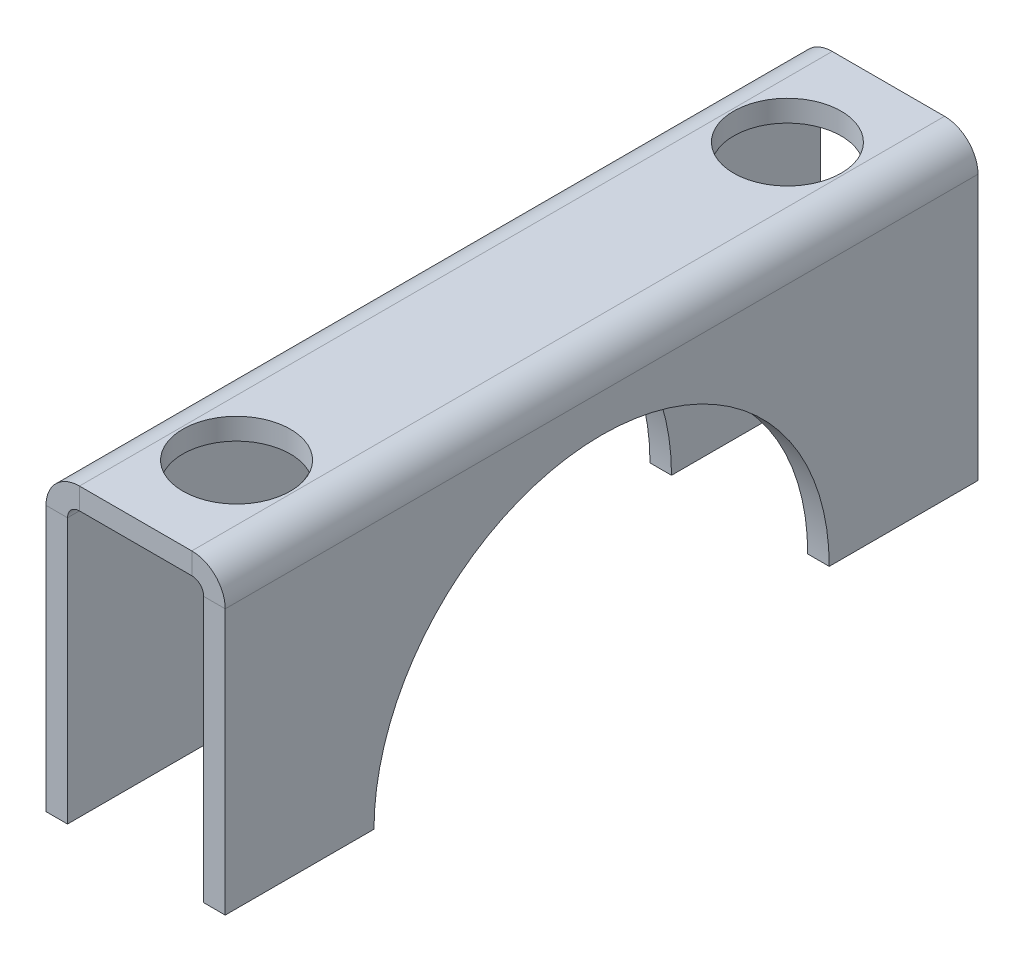
ISO-10303-21;
HEADER;
FILE_DESCRIPTION(('STEP AP214'),'2;1');
FILE_NAME('part.step','',(''),(''),'','','');
FILE_SCHEMA(('AUTOMOTIVE_DESIGN { 1 0 10303 214 1 1 1 1 }'));
ENDSEC;
DATA;
#1=APPLICATION_CONTEXT('core data for automotive mechanical design processes');
#2=APPLICATION_PROTOCOL_DEFINITION('international standard','automotive_design',2000,#1);
#3=PRODUCT_CONTEXT('',#1,'mechanical');
#4=PRODUCT('Part','Part','',(#3));
#5=PRODUCT_RELATED_PRODUCT_CATEGORY('part','',(#4));
#6=PRODUCT_DEFINITION_FORMATION('','',#4);
#7=PRODUCT_DEFINITION_CONTEXT('part definition',#1,'design');
#8=PRODUCT_DEFINITION('design','',#6,#7);
#9=PRODUCT_DEFINITION_SHAPE('','',#8);
#10=(LENGTH_UNIT() NAMED_UNIT(*) SI_UNIT(.MILLI.,.METRE.));
#11=(NAMED_UNIT(*) PLANE_ANGLE_UNIT() SI_UNIT($,.RADIAN.));
#12=(NAMED_UNIT(*) SI_UNIT($,.STERADIAN.) SOLID_ANGLE_UNIT());
#13=UNCERTAINTY_MEASURE_WITH_UNIT(LENGTH_MEASURE(1.E-05),#10,'distance_accuracy_value','');
#14=(GEOMETRIC_REPRESENTATION_CONTEXT(3) GLOBAL_UNCERTAINTY_ASSIGNED_CONTEXT((#13)) GLOBAL_UNIT_ASSIGNED_CONTEXT((#10,
#11,#12)) REPRESENTATION_CONTEXT('',''));
#15=CARTESIAN_POINT('',(0.,0.,0.));
#16=DIRECTION('',(0.,0.,1.));
#17=DIRECTION('',(1.,0.,0.));
#18=AXIS2_PLACEMENT_3D('',#15,#16,#17);
#19=CARTESIAN_POINT('',(15.,0.,63.));
#20=DIRECTION('',(0.,-1.,0.));
#21=DIRECTION('',(0.,0.,-1.));
#22=AXIS2_PLACEMENT_3D('',#19,#20,#21);
#23=PLANE('',#22);
#24=DIRECTION('',(1.,0.,0.));
#25=VECTOR('',#24,1.);
#26=CARTESIAN_POINT('',(-5.,0.,12.45));
#27=LINE('',#26,#25);
#28=CARTESIAN_POINT('',(13.2,0.,12.45));
#29=VERTEX_POINT('',#28);
#30=CARTESIAN_POINT('',(15.,0.,12.45));
#31=VERTEX_POINT('',#30);
#32=EDGE_CURVE('E53',#29,#31,#27,.T.);
#33=ORIENTED_EDGE('',*,*,#32,.F.);
#34=DIRECTION('',(0.,0.,-1.));
#35=VECTOR('',#34,1.);
#36=CARTESIAN_POINT('',(13.2,0.,63.));
#37=LINE('',#36,#35);
#38=CARTESIAN_POINT('',(13.2,0.,0.));
#39=VERTEX_POINT('',#38);
#40=EDGE_CURVE('E174',#29,#39,#37,.T.);
#41=ORIENTED_EDGE('',*,*,#40,.T.);
#42=DIRECTION('',(-1.,0.,0.));
#43=VECTOR('',#42,1.);
#44=CARTESIAN_POINT('',(15.,0.,0.));
#45=LINE('',#44,#43);
#46=CARTESIAN_POINT('',(15.,0.,0.));
#47=VERTEX_POINT('',#46);
#48=EDGE_CURVE('E242',#47,#39,#45,.T.);
#49=ORIENTED_EDGE('',*,*,#48,.F.);
#50=DIRECTION('',(0.,0.,-1.));
#51=VECTOR('',#50,1.);
#52=CARTESIAN_POINT('',(15.,0.,63.));
#53=LINE('',#52,#51);
#54=EDGE_CURVE('E175',#31,#47,#53,.T.);
#55=ORIENTED_EDGE('',*,*,#54,.F.);
#56=EDGE_LOOP('',(#33,#41,#49,#55));
#57=FACE_BOUND('',#56,.T.);
#58=ADVANCED_FACE('F38',(#57),#23,.T.);
#59=CARTESIAN_POINT('',(1.8,0.,63.));
#60=DIRECTION('',(0.,-1.,0.));
#61=DIRECTION('',(0.,0.,-1.));
#62=AXIS2_PLACEMENT_3D('',#59,#60,#61);
#63=PLANE('',#62);
#64=DIRECTION('',(1.,0.,0.));
#65=VECTOR('',#64,1.);
#66=CARTESIAN_POINT('',(-5.,0.,12.45));
#67=LINE('',#66,#65);
#68=CARTESIAN_POINT('',(0.,0.,12.45));
#69=VERTEX_POINT('',#68);
#70=CARTESIAN_POINT('',(1.8,0.,12.45));
#71=VERTEX_POINT('',#70);
#72=EDGE_CURVE('E61',#69,#71,#67,.T.);
#73=ORIENTED_EDGE('',*,*,#72,.F.);
#74=DIRECTION('',(0.,0.,-1.));
#75=VECTOR('',#74,1.);
#76=CARTESIAN_POINT('',(0.,0.,63.));
#77=LINE('',#76,#75);
#78=CARTESIAN_POINT('',(0.,0.,0.));
#79=VERTEX_POINT('',#78);
#80=EDGE_CURVE('E281',#69,#79,#77,.T.);
#81=ORIENTED_EDGE('',*,*,#80,.T.);
#82=DIRECTION('',(-1.,0.,0.));
#83=VECTOR('',#82,1.);
#84=CARTESIAN_POINT('',(1.8,0.,0.));
#85=LINE('',#84,#83);
#86=CARTESIAN_POINT('',(1.8,0.,0.));
#87=VERTEX_POINT('',#86);
#88=EDGE_CURVE('E260',#87,#79,#85,.T.);
#89=ORIENTED_EDGE('',*,*,#88,.F.);
#90=DIRECTION('',(0.,0.,-1.));
#91=VECTOR('',#90,1.);
#92=CARTESIAN_POINT('',(1.8,0.,63.));
#93=LINE('',#92,#91);
#94=EDGE_CURVE('E277',#71,#87,#93,.T.);
#95=ORIENTED_EDGE('',*,*,#94,.F.);
#96=EDGE_LOOP('',(#73,#81,#89,#95));
#97=FACE_BOUND('',#96,.T.);
#98=ADVANCED_FACE('F353',(#97),#63,.T.);
#99=CARTESIAN_POINT('',(2.8,25.,63.));
#100=DIRECTION('',(0.,0.,1.));
#101=DIRECTION('',(1.,0.,0.));
#102=AXIS2_PLACEMENT_3D('',#99,#100,#101);
#103=PLANE('',#102);
#104=DIRECTION('',(0.,-1.,0.));
#105=VECTOR('',#104,1.);
#106=CARTESIAN_POINT('',(2.8,25.,63.));
#107=LINE('',#106,#105);
#108=CARTESIAN_POINT('',(2.8,25.,63.));
#109=VERTEX_POINT('',#108);
#110=CARTESIAN_POINT('',(2.8,23.2,63.));
#111=VERTEX_POINT('',#110);
#112=EDGE_CURVE('E46',#109,#111,#107,.T.);
#113=ORIENTED_EDGE('',*,*,#112,.F.);
#114=CARTESIAN_POINT('',(2.8,22.2,63.));
#115=DIRECTION('',(0.,0.,1.));
#116=DIRECTION('',(1.,0.,0.));
#117=AXIS2_PLACEMENT_3D('',#114,#115,#116);
#118=CIRCLE('',#117,2.8);
#119=CARTESIAN_POINT('',(0.,22.2,63.));
#120=VERTEX_POINT('',#119);
#121=EDGE_CURVE('E318',#120,#109,#118,.F.);
#122=ORIENTED_EDGE('',*,*,#121,.F.);
#123=DIRECTION('',(-1.,0.,0.));
#124=VECTOR('',#123,1.);
#125=CARTESIAN_POINT('',(1.8,22.2,63.));
#126=LINE('',#125,#124);
#127=CARTESIAN_POINT('',(1.8,22.2,63.));
#128=VERTEX_POINT('',#127);
#129=EDGE_CURVE('E194',#128,#120,#126,.T.);
#130=ORIENTED_EDGE('',*,*,#129,.F.);
#131=CARTESIAN_POINT('',(2.8,22.2,63.));
#132=DIRECTION('',(0.,0.,1.));
#133=DIRECTION('',(1.,0.,0.));
#134=AXIS2_PLACEMENT_3D('',#131,#132,#133);
#135=CIRCLE('',#134,1.);
#136=EDGE_CURVE('E210',#128,#111,#135,.F.);
#137=ORIENTED_EDGE('',*,*,#136,.T.);
#138=EDGE_LOOP('',(#113,#122,#130,#137));
#139=FACE_BOUND('',#138,.T.);
#140=ADVANCED_FACE('F40',(#139),#103,.T.);
#141=CARTESIAN_POINT('',(1.8,22.2,63.));
#142=DIRECTION('',(0.,0.,1.));
#143=DIRECTION('',(1.,0.,0.));
#144=AXIS2_PLACEMENT_3D('',#141,#142,#143);
#145=PLANE('',#144);
#146=DIRECTION('',(1.,0.,0.));
#147=VECTOR('',#146,1.);
#148=CARTESIAN_POINT('',(0.,25.,63.));
#149=LINE('',#148,#147);
#150=CARTESIAN_POINT('',(12.2,25.,63.));
#151=VERTEX_POINT('',#150);
#152=EDGE_CURVE('E204',#109,#151,#149,.T.);
#153=ORIENTED_EDGE('',*,*,#152,.F.);
#154=ORIENTED_EDGE('',*,*,#112,.T.);
#155=DIRECTION('',(1.,0.,0.));
#156=VECTOR('',#155,1.);
#157=CARTESIAN_POINT('',(0.,23.2,63.));
#158=LINE('',#157,#156);
#159=CARTESIAN_POINT('',(12.2,23.2,63.));
#160=VERTEX_POINT('',#159);
#161=EDGE_CURVE('E201',#111,#160,#158,.T.);
#162=ORIENTED_EDGE('',*,*,#161,.T.);
#163=DIRECTION('',(0.,1.,0.));
#164=VECTOR('',#163,1.);
#165=CARTESIAN_POINT('',(12.2,23.2,63.));
#166=LINE('',#165,#164);
#167=EDGE_CURVE('E186',#160,#151,#166,.T.);
#168=ORIENTED_EDGE('',*,*,#167,.T.);
#169=EDGE_LOOP('',(#153,#154,#162,#168));
#170=FACE_BOUND('',#169,.T.);
#171=ADVANCED_FACE('F199',(#170),#145,.T.);
#172=CARTESIAN_POINT('',(0.,22.2,0.));
#173=DIRECTION('',(0.,0.,-1.));
#174=DIRECTION('',(-1.,0.,0.));
#175=AXIS2_PLACEMENT_3D('',#172,#173,#174);
#176=PLANE('',#175);
#177=DIRECTION('',(1.,0.,0.));
#178=VECTOR('',#177,1.);
#179=CARTESIAN_POINT('',(0.,22.2,0.));
#180=LINE('',#179,#178);
#181=CARTESIAN_POINT('',(0.,22.2,0.));
#182=VERTEX_POINT('',#181);
#183=CARTESIAN_POINT('',(1.8,22.2,0.));
#184=VERTEX_POINT('',#183);
#185=EDGE_CURVE('E192',#182,#184,#180,.T.);
#186=ORIENTED_EDGE('',*,*,#185,.F.);
#187=CARTESIAN_POINT('',(2.8,22.2,0.));
#188=DIRECTION('',(0.,0.,1.));
#189=DIRECTION('',(1.,0.,0.));
#190=AXIS2_PLACEMENT_3D('',#187,#188,#189);
#191=CIRCLE('',#190,2.8);
#192=CARTESIAN_POINT('',(2.8,25.,0.));
#193=VERTEX_POINT('',#192);
#194=EDGE_CURVE('E254',#182,#193,#191,.F.);
#195=ORIENTED_EDGE('',*,*,#194,.T.);
#196=DIRECTION('',(0.,1.,0.));
#197=VECTOR('',#196,1.);
#198=CARTESIAN_POINT('',(2.8,23.2,0.));
#199=LINE('',#198,#197);
#200=CARTESIAN_POINT('',(2.8,23.2,0.));
#201=VERTEX_POINT('',#200);
#202=EDGE_CURVE('E190',#201,#193,#199,.T.);
#203=ORIENTED_EDGE('',*,*,#202,.F.);
#204=CARTESIAN_POINT('',(2.8,22.2,0.));
#205=DIRECTION('',(0.,0.,1.));
#206=DIRECTION('',(1.,0.,0.));
#207=AXIS2_PLACEMENT_3D('',#204,#205,#206);
#208=CIRCLE('',#207,1.);
#209=EDGE_CURVE('E222',#184,#201,#208,.F.);
#210=ORIENTED_EDGE('',*,*,#209,.F.);
#211=EDGE_LOOP('',(#186,#195,#203,#210));
#212=FACE_BOUND('',#211,.T.);
#213=ADVANCED_FACE('F339',(#212),#176,.T.);
#214=CARTESIAN_POINT('',(2.8,23.2,0.));
#215=DIRECTION('',(0.,0.,-1.));
#216=DIRECTION('',(-1.,0.,0.));
#217=AXIS2_PLACEMENT_3D('',#214,#215,#216);
#218=PLANE('',#217);
#219=DIRECTION('',(0.,1.,0.));
#220=VECTOR('',#219,1.);
#221=CARTESIAN_POINT('',(0.,0.,0.));
#222=LINE('',#221,#220);
#223=EDGE_CURVE('E257',#79,#182,#222,.T.);
#224=ORIENTED_EDGE('',*,*,#223,.T.);
#225=ORIENTED_EDGE('',*,*,#185,.T.);
#226=DIRECTION('',(0.,1.,0.));
#227=VECTOR('',#226,1.);
#228=CARTESIAN_POINT('',(1.8,0.,0.));
#229=LINE('',#228,#227);
#230=EDGE_CURVE('E263',#87,#184,#229,.T.);
#231=ORIENTED_EDGE('',*,*,#230,.F.);
#232=ORIENTED_EDGE('',*,*,#88,.T.);
#233=EDGE_LOOP('',(#224,#225,#231,#232));
#234=FACE_BOUND('',#233,.T.);
#235=ADVANCED_FACE('F356',(#234),#218,.T.);
#236=CARTESIAN_POINT('',(15.,22.2,63.));
#237=DIRECTION('',(0.,0.,1.));
#238=DIRECTION('',(1.,0.,0.));
#239=AXIS2_PLACEMENT_3D('',#236,#237,#238);
#240=PLANE('',#239);
#241=DIRECTION('',(-1.,0.,0.));
#242=VECTOR('',#241,1.);
#243=CARTESIAN_POINT('',(15.,22.2,63.));
#244=LINE('',#243,#242);
#245=CARTESIAN_POINT('',(15.,22.2,63.));
#246=VERTEX_POINT('',#245);
#247=CARTESIAN_POINT('',(13.2,22.2,63.));
#248=VERTEX_POINT('',#247);
#249=EDGE_CURVE('E188',#246,#248,#244,.T.);
#250=ORIENTED_EDGE('',*,*,#249,.F.);
#251=CARTESIAN_POINT('',(12.2,22.2,63.));
#252=DIRECTION('',(0.,0.,1.));
#253=DIRECTION('',(1.,0.,0.));
#254=AXIS2_PLACEMENT_3D('',#251,#252,#253);
#255=CIRCLE('',#254,2.8);
#256=EDGE_CURVE('E302',#151,#246,#255,.F.);
#257=ORIENTED_EDGE('',*,*,#256,.F.);
#258=ORIENTED_EDGE('',*,*,#167,.F.);
#259=CARTESIAN_POINT('',(12.2,22.2,63.));
#260=DIRECTION('',(0.,0.,1.));
#261=DIRECTION('',(1.,0.,0.));
#262=AXIS2_PLACEMENT_3D('',#259,#260,#261);
#263=CIRCLE('',#262,1.);
#264=EDGE_CURVE('E232',#160,#248,#263,.F.);
#265=ORIENTED_EDGE('',*,*,#264,.T.);
#266=EDGE_LOOP('',(#250,#257,#258,#265));
#267=FACE_BOUND('',#266,.T.);
#268=ADVANCED_FACE('F315',(#267),#240,.T.);
#269=CARTESIAN_POINT('',(12.2,23.2,63.));
#270=DIRECTION('',(0.,0.,1.));
#271=DIRECTION('',(1.,0.,0.));
#272=AXIS2_PLACEMENT_3D('',#269,#270,#271);
#273=PLANE('',#272);
#274=DIRECTION('',(0.,-1.,0.));
#275=VECTOR('',#274,1.);
#276=CARTESIAN_POINT('',(15.,25.,63.));
#277=LINE('',#276,#275);
#278=CARTESIAN_POINT('',(15.,0.,63.));
#279=VERTEX_POINT('',#278);
#280=EDGE_CURVE('E173',#246,#279,#277,.T.);
#281=ORIENTED_EDGE('',*,*,#280,.F.);
#282=ORIENTED_EDGE('',*,*,#249,.T.);
#283=DIRECTION('',(0.,-1.,0.));
#284=VECTOR('',#283,1.);
#285=CARTESIAN_POINT('',(13.2,25.,63.));
#286=LINE('',#285,#284);
#287=CARTESIAN_POINT('',(13.2,0.,63.));
#288=VERTEX_POINT('',#287);
#289=EDGE_CURVE('E272',#248,#288,#286,.T.);
#290=ORIENTED_EDGE('',*,*,#289,.T.);
#291=DIRECTION('',(-1.,0.,0.));
#292=VECTOR('',#291,1.);
#293=CARTESIAN_POINT('',(15.,0.,63.));
#294=LINE('',#293,#292);
#295=EDGE_CURVE('E364',#279,#288,#294,.T.);
#296=ORIENTED_EDGE('',*,*,#295,.F.);
#297=EDGE_LOOP('',(#281,#282,#290,#296));
#298=FACE_BOUND('',#297,.T.);
#299=ADVANCED_FACE('F366',(#298),#273,.T.);
#300=CARTESIAN_POINT('',(12.2,25.,0.));
#301=DIRECTION('',(0.,0.,-1.));
#302=DIRECTION('',(-1.,0.,0.));
#303=AXIS2_PLACEMENT_3D('',#300,#301,#302);
#304=PLANE('',#303);
#305=DIRECTION('',(0.,-1.,0.));
#306=VECTOR('',#305,1.);
#307=CARTESIAN_POINT('',(12.2,25.,0.));
#308=LINE('',#307,#306);
#309=CARTESIAN_POINT('',(12.2,25.,0.));
#310=VERTEX_POINT('',#309);
#311=CARTESIAN_POINT('',(12.2,23.2,0.));
#312=VERTEX_POINT('',#311);
#313=EDGE_CURVE('E184',#310,#312,#308,.T.);
#314=ORIENTED_EDGE('',*,*,#313,.F.);
#315=CARTESIAN_POINT('',(12.2,22.2,0.));
#316=DIRECTION('',(0.,0.,1.));
#317=DIRECTION('',(1.,0.,0.));
#318=AXIS2_PLACEMENT_3D('',#315,#316,#317);
#319=CIRCLE('',#318,2.8);
#320=CARTESIAN_POINT('',(15.,22.2,0.));
#321=VERTEX_POINT('',#320);
#322=EDGE_CURVE('E248',#310,#321,#319,.F.);
#323=ORIENTED_EDGE('',*,*,#322,.T.);
#324=DIRECTION('',(1.,0.,0.));
#325=VECTOR('',#324,1.);
#326=CARTESIAN_POINT('',(13.2,22.2,0.));
#327=LINE('',#326,#325);
#328=CARTESIAN_POINT('',(13.2,22.2,0.));
#329=VERTEX_POINT('',#328);
#330=EDGE_CURVE('E182',#329,#321,#327,.T.);
#331=ORIENTED_EDGE('',*,*,#330,.F.);
#332=CARTESIAN_POINT('',(12.2,22.2,0.));
#333=DIRECTION('',(0.,0.,1.));
#334=DIRECTION('',(1.,0.,0.));
#335=AXIS2_PLACEMENT_3D('',#332,#333,#334);
#336=CIRCLE('',#335,1.);
#337=EDGE_CURVE('E269',#312,#329,#336,.F.);
#338=ORIENTED_EDGE('',*,*,#337,.F.);
#339=EDGE_LOOP('',(#314,#323,#331,#338));
#340=FACE_BOUND('',#339,.T.);
#341=ADVANCED_FACE('F306',(#340),#304,.T.);
#342=CARTESIAN_POINT('',(13.2,22.2,0.));
#343=DIRECTION('',(0.,0.,-1.));
#344=DIRECTION('',(-1.,0.,0.));
#345=AXIS2_PLACEMENT_3D('',#342,#343,#344);
#346=PLANE('',#345);
#347=DIRECTION('',(1.,0.,0.));
#348=VECTOR('',#347,1.);
#349=CARTESIAN_POINT('',(0.,25.,0.));
#350=LINE('',#349,#348);
#351=EDGE_CURVE('E251',#193,#310,#350,.T.);
#352=ORIENTED_EDGE('',*,*,#351,.T.);
#353=ORIENTED_EDGE('',*,*,#313,.T.);
#354=DIRECTION('',(1.,0.,0.));
#355=VECTOR('',#354,1.);
#356=CARTESIAN_POINT('',(0.,23.2,0.));
#357=LINE('',#356,#355);
#358=EDGE_CURVE('E267',#201,#312,#357,.T.);
#359=ORIENTED_EDGE('',*,*,#358,.F.);
#360=ORIENTED_EDGE('',*,*,#202,.T.);
#361=EDGE_LOOP('',(#352,#353,#359,#360));
#362=FACE_BOUND('',#361,.T.);
#363=ADVANCED_FACE('F309',(#362),#346,.T.);
#364=CARTESIAN_POINT('',(13.2,25.,63.));
#365=DIRECTION('',(1.,0.,0.));
#366=DIRECTION('',(0.,1.,0.));
#367=AXIS2_PLACEMENT_3D('',#364,#365,#366);
#368=PLANE('',#367);
#369=ORIENTED_EDGE('',*,*,#40,.F.);
#370=CARTESIAN_POINT('',(13.2,0.,31.5));
#371=DIRECTION('',(1.,0.,0.));
#372=DIRECTION('',(0.,1.,0.));
#373=AXIS2_PLACEMENT_3D('',#370,#371,#372);
#374=CIRCLE('',#373,19.05);
#375=CARTESIAN_POINT('',(13.2,0.,50.55));
#376=VERTEX_POINT('',#375);
#377=EDGE_CURVE('E166',#29,#376,#374,.T.);
#378=ORIENTED_EDGE('',*,*,#377,.T.);
#379=EDGE_CURVE('E165',#288,#376,#37,.T.);
#380=ORIENTED_EDGE('',*,*,#379,.F.);
#381=ORIENTED_EDGE('',*,*,#289,.F.);
#382=DIRECTION('',(0.,0.,-1.));
#383=VECTOR('',#382,1.);
#384=CARTESIAN_POINT('',(13.2,22.2,63.));
#385=LINE('',#384,#383);
#386=EDGE_CURVE('E235',#248,#329,#385,.T.);
#387=ORIENTED_EDGE('',*,*,#386,.T.);
#388=DIRECTION('',(0.,-1.,0.));
#389=VECTOR('',#388,1.);
#390=CARTESIAN_POINT('',(13.2,25.,0.));
#391=LINE('',#390,#389);
#392=EDGE_CURVE('E239',#329,#39,#391,.T.);
#393=ORIENTED_EDGE('',*,*,#392,.T.);
#394=EDGE_LOOP('',(#369,#378,#380,#381,#387,#393));
#395=FACE_BOUND('',#394,.T.);
#396=ADVANCED_FACE('F369',(#395),#368,.F.);
#397=DIRECTION('',(1.,0.,0.));
#398=VECTOR('',#397,1.);
#399=CARTESIAN_POINT('',(-5.,0.,50.55));
#400=LINE('',#399,#398);
#401=CARTESIAN_POINT('',(15.,0.,50.55));
#402=VERTEX_POINT('',#401);
#403=EDGE_CURVE('E150',#402,#376,#400,.F.);
#404=ORIENTED_EDGE('',*,*,#403,.F.);
#405=EDGE_CURVE('E162',#279,#402,#53,.T.);
#406=ORIENTED_EDGE('',*,*,#405,.F.);
#407=ORIENTED_EDGE('',*,*,#295,.T.);
#408=ORIENTED_EDGE('',*,*,#379,.T.);
#409=EDGE_LOOP('',(#404,#406,#407,#408));
#410=FACE_BOUND('',#409,.T.);
#411=ADVANCED_FACE('F160',(#410),#23,.T.);
#412=CARTESIAN_POINT('',(15.,25.,63.));
#413=DIRECTION('',(1.,0.,0.));
#414=DIRECTION('',(0.,1.,0.));
#415=AXIS2_PLACEMENT_3D('',#412,#413,#414);
#416=PLANE('',#415);
#417=CARTESIAN_POINT('',(15.,0.,31.5));
#418=DIRECTION('',(1.,0.,0.));
#419=DIRECTION('',(0.,1.,0.));
#420=AXIS2_PLACEMENT_3D('',#417,#418,#419);
#421=CIRCLE('',#420,19.05);
#422=EDGE_CURVE('E147',#31,#402,#421,.T.);
#423=ORIENTED_EDGE('',*,*,#422,.F.);
#424=ORIENTED_EDGE('',*,*,#54,.T.);
#425=DIRECTION('',(0.,-1.,0.));
#426=VECTOR('',#425,1.);
#427=CARTESIAN_POINT('',(15.,25.,0.));
#428=LINE('',#427,#426);
#429=EDGE_CURVE('E245',#321,#47,#428,.T.);
#430=ORIENTED_EDGE('',*,*,#429,.F.);
#431=DIRECTION('',(0.,0.,-1.));
#432=VECTOR('',#431,1.);
#433=CARTESIAN_POINT('',(15.,22.2,63.));
#434=LINE('',#433,#432);
#435=EDGE_CURVE('E178',#246,#321,#434,.T.);
#436=ORIENTED_EDGE('',*,*,#435,.F.);
#437=ORIENTED_EDGE('',*,*,#280,.T.);
#438=ORIENTED_EDGE('',*,*,#405,.T.);
#439=EDGE_LOOP('',(#423,#424,#430,#436,#437,#438));
#440=FACE_BOUND('',#439,.T.);
#441=ADVANCED_FACE('F170',(#440),#416,.T.);
#442=CARTESIAN_POINT('',(12.2,22.2,63.));
#443=DIRECTION('',(0.,0.,-1.));
#444=DIRECTION('',(-1.,0.,0.));
#445=AXIS2_PLACEMENT_3D('',#442,#443,#444);
#446=CYLINDRICAL_SURFACE('',#445,2.8);
#447=ORIENTED_EDGE('',*,*,#322,.F.);
#448=DIRECTION('',(0.,0.,-1.));
#449=VECTOR('',#448,1.);
#450=CARTESIAN_POINT('',(12.2,25.,63.));
#451=LINE('',#450,#449);
#452=EDGE_CURVE('E290',#151,#310,#451,.T.);
#453=ORIENTED_EDGE('',*,*,#452,.F.);
#454=ORIENTED_EDGE('',*,*,#256,.T.);
#455=ORIENTED_EDGE('',*,*,#435,.T.);
#456=EDGE_LOOP('',(#447,#453,#454,#455));
#457=FACE_BOUND('',#456,.T.);
#458=ADVANCED_FACE('F300',(#457),#446,.T.);
#459=CARTESIAN_POINT('',(0.,25.,63.));
#460=DIRECTION('',(0.,1.,0.));
#461=DIRECTION('',(0.,0.,1.));
#462=AXIS2_PLACEMENT_3D('',#459,#460,#461);
#463=PLANE('',#462);
#464=CARTESIAN_POINT('',(7.5,25.,8.45));
#465=DIRECTION('',(0.,1.,0.));
#466=DIRECTION('',(0.,0.,1.));
#467=AXIS2_PLACEMENT_3D('',#464,#465,#466);
#468=CIRCLE('',#467,4.5);
#469=CARTESIAN_POINT('',(7.5,25.,12.95));
#470=VERTEX_POINT('',#469);
#471=EDGE_CURVE('E658',#470,#470,#468,.T.);
#472=ORIENTED_EDGE('',*,*,#471,.F.);
#473=EDGE_LOOP('',(#472));
#474=FACE_BOUND('',#473,.T.);
#475=CARTESIAN_POINT('',(7.5,25.,54.55));
#476=DIRECTION('',(0.,1.,0.));
#477=DIRECTION('',(0.,0.,1.));
#478=AXIS2_PLACEMENT_3D('',#475,#476,#477);
#479=CIRCLE('',#478,4.5);
#480=CARTESIAN_POINT('',(7.5,25.,59.05));
#481=VERTEX_POINT('',#480);
#482=EDGE_CURVE('E662',#481,#481,#479,.T.);
#483=ORIENTED_EDGE('',*,*,#482,.F.);
#484=EDGE_LOOP('',(#483));
#485=FACE_BOUND('',#484,.T.);
#486=ORIENTED_EDGE('',*,*,#351,.F.);
#487=DIRECTION('',(0.,0.,-1.));
#488=VECTOR('',#487,1.);
#489=CARTESIAN_POINT('',(2.8,25.,63.));
#490=LINE('',#489,#488);
#491=EDGE_CURVE('E288',#109,#193,#490,.T.);
#492=ORIENTED_EDGE('',*,*,#491,.F.);
#493=ORIENTED_EDGE('',*,*,#152,.T.);
#494=ORIENTED_EDGE('',*,*,#452,.T.);
#495=EDGE_LOOP('',(#486,#492,#493,#494));
#496=FACE_BOUND('',#495,.T.);
#497=ADVANCED_FACE('F317',(#474,#485,#496),#463,.T.);
#498=CARTESIAN_POINT('',(2.8,22.2,63.));
#499=DIRECTION('',(0.,0.,-1.));
#500=DIRECTION('',(-1.,0.,0.));
#501=AXIS2_PLACEMENT_3D('',#498,#499,#500);
#502=CYLINDRICAL_SURFACE('',#501,2.8);
#503=ORIENTED_EDGE('',*,*,#194,.F.);
#504=DIRECTION('',(0.,0.,-1.));
#505=VECTOR('',#504,1.);
#506=CARTESIAN_POINT('',(0.,22.2,63.));
#507=LINE('',#506,#505);
#508=EDGE_CURVE('E285',#120,#182,#507,.T.);
#509=ORIENTED_EDGE('',*,*,#508,.F.);
#510=ORIENTED_EDGE('',*,*,#121,.T.);
#511=ORIENTED_EDGE('',*,*,#491,.T.);
#512=EDGE_LOOP('',(#503,#509,#510,#511));
#513=FACE_BOUND('',#512,.T.);
#514=ADVANCED_FACE('F342',(#513),#502,.T.);
#515=CARTESIAN_POINT('',(0.,0.,63.));
#516=DIRECTION('',(-1.,0.,0.));
#517=DIRECTION('',(0.,0.,1.));
#518=AXIS2_PLACEMENT_3D('',#515,#516,#517);
#519=PLANE('',#518);
#520=CARTESIAN_POINT('',(0.,0.,31.5));
#521=DIRECTION('',(-1.,0.,0.));
#522=DIRECTION('',(0.,0.,1.));
#523=AXIS2_PLACEMENT_3D('',#520,#521,#522);
#524=CIRCLE('',#523,19.05);
#525=CARTESIAN_POINT('',(0.,0.,50.55));
#526=VERTEX_POINT('',#525);
#527=EDGE_CURVE('E167',#526,#69,#524,.T.);
#528=ORIENTED_EDGE('',*,*,#527,.F.);
#529=CARTESIAN_POINT('',(0.,0.,63.));
#530=VERTEX_POINT('',#529);
#531=EDGE_CURVE('E282',#530,#526,#77,.T.);
#532=ORIENTED_EDGE('',*,*,#531,.F.);
#533=DIRECTION('',(0.,1.,0.));
#534=VECTOR('',#533,1.);
#535=CARTESIAN_POINT('',(0.,0.,63.));
#536=LINE('',#535,#534);
#537=EDGE_CURVE('E320',#530,#120,#536,.T.);
#538=ORIENTED_EDGE('',*,*,#537,.T.);
#539=ORIENTED_EDGE('',*,*,#508,.T.);
#540=ORIENTED_EDGE('',*,*,#223,.F.);
#541=ORIENTED_EDGE('',*,*,#80,.F.);
#542=EDGE_LOOP('',(#528,#532,#538,#539,#540,#541));
#543=FACE_BOUND('',#542,.T.);
#544=ADVANCED_FACE('F345',(#543),#519,.T.);
#545=DIRECTION('',(1.,0.,0.));
#546=VECTOR('',#545,1.);
#547=CARTESIAN_POINT('',(-5.,0.,50.55));
#548=LINE('',#547,#546);
#549=CARTESIAN_POINT('',(1.8,0.,50.55));
#550=VERTEX_POINT('',#549);
#551=EDGE_CURVE('E155',#550,#526,#548,.F.);
#552=ORIENTED_EDGE('',*,*,#551,.F.);
#553=CARTESIAN_POINT('',(1.8,0.,63.));
#554=VERTEX_POINT('',#553);
#555=EDGE_CURVE('E278',#554,#550,#93,.T.);
#556=ORIENTED_EDGE('',*,*,#555,.F.);
#557=DIRECTION('',(-1.,0.,0.));
#558=VECTOR('',#557,1.);
#559=CARTESIAN_POINT('',(1.8,0.,63.));
#560=LINE('',#559,#558);
#561=EDGE_CURVE('E326',#554,#530,#560,.T.);
#562=ORIENTED_EDGE('',*,*,#561,.T.);
#563=ORIENTED_EDGE('',*,*,#531,.T.);
#564=EDGE_LOOP('',(#552,#556,#562,#563));
#565=FACE_BOUND('',#564,.T.);
#566=ADVANCED_FACE('F349',(#565),#63,.T.);
#567=CARTESIAN_POINT('',(1.8,0.,63.));
#568=DIRECTION('',(-1.,0.,0.));
#569=DIRECTION('',(0.,0.,1.));
#570=AXIS2_PLACEMENT_3D('',#567,#568,#569);
#571=PLANE('',#570);
#572=ORIENTED_EDGE('',*,*,#555,.T.);
#573=CARTESIAN_POINT('',(1.8,0.,31.5));
#574=DIRECTION('',(-1.,0.,0.));
#575=DIRECTION('',(0.,0.,1.));
#576=AXIS2_PLACEMENT_3D('',#573,#574,#575);
#577=CIRCLE('',#576,19.05);
#578=EDGE_CURVE('E11',#550,#71,#577,.T.);
#579=ORIENTED_EDGE('',*,*,#578,.T.);
#580=ORIENTED_EDGE('',*,*,#94,.T.);
#581=ORIENTED_EDGE('',*,*,#230,.T.);
#582=DIRECTION('',(0.,0.,-1.));
#583=VECTOR('',#582,1.);
#584=CARTESIAN_POINT('',(1.8,22.2,63.));
#585=LINE('',#584,#583);
#586=EDGE_CURVE('E226',#128,#184,#585,.T.);
#587=ORIENTED_EDGE('',*,*,#586,.F.);
#588=DIRECTION('',(0.,1.,0.));
#589=VECTOR('',#588,1.);
#590=CARTESIAN_POINT('',(1.8,0.,63.));
#591=LINE('',#590,#589);
#592=EDGE_CURVE('E215',#554,#128,#591,.T.);
#593=ORIENTED_EDGE('',*,*,#592,.F.);
#594=EDGE_LOOP('',(#572,#579,#580,#581,#587,#593));
#595=FACE_BOUND('',#594,.T.);
#596=ADVANCED_FACE('F336',(#595),#571,.F.);
#597=CARTESIAN_POINT('',(2.8,22.2,63.));
#598=DIRECTION('',(0.,0.,-1.));
#599=DIRECTION('',(-1.,0.,0.));
#600=AXIS2_PLACEMENT_3D('',#597,#598,#599);
#601=CYLINDRICAL_SURFACE('',#600,1.);
#602=ORIENTED_EDGE('',*,*,#209,.T.);
#603=DIRECTION('',(0.,0.,-1.));
#604=VECTOR('',#603,1.);
#605=CARTESIAN_POINT('',(2.8,23.2,63.));
#606=LINE('',#605,#604);
#607=EDGE_CURVE('E219',#111,#201,#606,.T.);
#608=ORIENTED_EDGE('',*,*,#607,.F.);
#609=ORIENTED_EDGE('',*,*,#136,.F.);
#610=ORIENTED_EDGE('',*,*,#586,.T.);
#611=EDGE_LOOP('',(#602,#608,#609,#610));
#612=FACE_BOUND('',#611,.T.);
#613=ADVANCED_FACE('F220',(#612),#601,.F.);
#614=CARTESIAN_POINT('',(0.,23.2,63.));
#615=DIRECTION('',(0.,1.,0.));
#616=DIRECTION('',(0.,0.,1.));
#617=AXIS2_PLACEMENT_3D('',#614,#615,#616);
#618=PLANE('',#617);
#619=CARTESIAN_POINT('',(7.5,23.2,8.45));
#620=DIRECTION('',(0.,1.,0.));
#621=DIRECTION('',(0.,0.,1.));
#622=AXIS2_PLACEMENT_3D('',#619,#620,#621);
#623=CIRCLE('',#622,4.5);
#624=CARTESIAN_POINT('',(7.5,23.2,12.95));
#625=VERTEX_POINT('',#624);
#626=EDGE_CURVE('E661',#625,#625,#623,.F.);
#627=ORIENTED_EDGE('',*,*,#626,.F.);
#628=EDGE_LOOP('',(#627));
#629=FACE_BOUND('',#628,.T.);
#630=CARTESIAN_POINT('',(7.5,23.2,54.55));
#631=DIRECTION('',(0.,1.,0.));
#632=DIRECTION('',(0.,0.,1.));
#633=AXIS2_PLACEMENT_3D('',#630,#631,#632);
#634=CIRCLE('',#633,4.5);
#635=CARTESIAN_POINT('',(7.5,23.2,59.05));
#636=VERTEX_POINT('',#635);
#637=EDGE_CURVE('E156',#636,#636,#634,.F.);
#638=ORIENTED_EDGE('',*,*,#637,.F.);
#639=EDGE_LOOP('',(#638));
#640=FACE_BOUND('',#639,.T.);
#641=ORIENTED_EDGE('',*,*,#358,.T.);
#642=DIRECTION('',(0.,0.,-1.));
#643=VECTOR('',#642,1.);
#644=CARTESIAN_POINT('',(12.2,23.2,63.));
#645=LINE('',#644,#643);
#646=EDGE_CURVE('E227',#160,#312,#645,.T.);
#647=ORIENTED_EDGE('',*,*,#646,.F.);
#648=ORIENTED_EDGE('',*,*,#161,.F.);
#649=ORIENTED_EDGE('',*,*,#607,.T.);
#650=EDGE_LOOP('',(#641,#647,#648,#649));
#651=FACE_BOUND('',#650,.T.);
#652=ADVANCED_FACE('F229',(#629,#640,#651),#618,.F.);
#653=CARTESIAN_POINT('',(12.2,22.2,63.));
#654=DIRECTION('',(0.,0.,-1.));
#655=DIRECTION('',(-1.,0.,0.));
#656=AXIS2_PLACEMENT_3D('',#653,#654,#655);
#657=CYLINDRICAL_SURFACE('',#656,1.);
#658=ORIENTED_EDGE('',*,*,#337,.T.);
#659=ORIENTED_EDGE('',*,*,#386,.F.);
#660=ORIENTED_EDGE('',*,*,#264,.F.);
#661=ORIENTED_EDGE('',*,*,#646,.T.);
#662=EDGE_LOOP('',(#658,#659,#660,#661));
#663=FACE_BOUND('',#662,.T.);
#664=ADVANCED_FACE('F311',(#663),#657,.F.);
#665=CARTESIAN_POINT('',(12.2,22.2,63.));
#666=DIRECTION('',(0.,0.,1.));
#667=DIRECTION('',(1.,0.,0.));
#668=AXIS2_PLACEMENT_3D('',#665,#666,#667);
#669=PLANE('',#668);
#670=ORIENTED_EDGE('',*,*,#592,.T.);
#671=ORIENTED_EDGE('',*,*,#129,.T.);
#672=ORIENTED_EDGE('',*,*,#537,.F.);
#673=ORIENTED_EDGE('',*,*,#561,.F.);
#674=EDGE_LOOP('',(#670,#671,#672,#673));
#675=FACE_BOUND('',#674,.T.);
#676=ADVANCED_FACE('F332',(#675),#669,.T.);
#677=CARTESIAN_POINT('',(12.2,22.2,0.));
#678=DIRECTION('',(0.,0.,1.));
#679=DIRECTION('',(1.,0.,0.));
#680=AXIS2_PLACEMENT_3D('',#677,#678,#679);
#681=PLANE('',#680);
#682=ORIENTED_EDGE('',*,*,#392,.F.);
#683=ORIENTED_EDGE('',*,*,#330,.T.);
#684=ORIENTED_EDGE('',*,*,#429,.T.);
#685=ORIENTED_EDGE('',*,*,#48,.T.);
#686=EDGE_LOOP('',(#682,#683,#684,#685));
#687=FACE_BOUND('',#686,.T.);
#688=ADVANCED_FACE('F372',(#687),#681,.F.);
#689=CARTESIAN_POINT('',(-5.,0.,31.5));
#690=DIRECTION('',(1.,0.,0.));
#691=DIRECTION('',(0.,1.,0.));
#692=AXIS2_PLACEMENT_3D('',#689,#690,#691);
#693=CYLINDRICAL_SURFACE('',#692,19.05);
#694=ORIENTED_EDGE('',*,*,#527,.T.);
#695=ORIENTED_EDGE('',*,*,#72,.T.);
#696=ORIENTED_EDGE('',*,*,#578,.F.);
#697=ORIENTED_EDGE('',*,*,#551,.T.);
#698=EDGE_LOOP('',(#694,#695,#696,#697));
#699=FACE_BOUND('',#698,.T.);
#700=ADVANCED_FACE('F374',(#699),#693,.F.);
#701=ORIENTED_EDGE('',*,*,#32,.T.);
#702=ORIENTED_EDGE('',*,*,#422,.T.);
#703=ORIENTED_EDGE('',*,*,#403,.T.);
#704=ORIENTED_EDGE('',*,*,#377,.F.);
#705=EDGE_LOOP('',(#701,#702,#703,#704));
#706=FACE_BOUND('',#705,.T.);
#707=ADVANCED_FACE('F149',(#706),#693,.F.);
#708=CARTESIAN_POINT('',(7.5,-0.001000000000001,54.55));
#709=DIRECTION('',(0.,1.,0.));
#710=DIRECTION('',(0.,0.,1.));
#711=AXIS2_PLACEMENT_3D('',#708,#709,#710);
#712=CYLINDRICAL_SURFACE('',#711,4.5);
#713=ORIENTED_EDGE('',*,*,#482,.T.);
#714=EDGE_LOOP('',(#713));
#715=FACE_BOUND('',#714,.T.);
#716=ORIENTED_EDGE('',*,*,#637,.T.);
#717=EDGE_LOOP('',(#716));
#718=FACE_BOUND('',#717,.T.);
#719=ADVANCED_FACE('F490',(#715,#718),#712,.F.);
#720=CARTESIAN_POINT('',(7.5,-0.001000000000001,8.45));
#721=DIRECTION('',(0.,1.,0.));
#722=DIRECTION('',(0.,0.,1.));
#723=AXIS2_PLACEMENT_3D('',#720,#721,#722);
#724=CYLINDRICAL_SURFACE('',#723,4.5);
#725=ORIENTED_EDGE('',*,*,#471,.T.);
#726=EDGE_LOOP('',(#725));
#727=FACE_BOUND('',#726,.T.);
#728=ORIENTED_EDGE('',*,*,#626,.T.);
#729=EDGE_LOOP('',(#728));
#730=FACE_BOUND('',#729,.T.);
#731=ADVANCED_FACE('F521',(#727,#730),#724,.F.);
#732=CLOSED_SHELL('',(#58,#98,#140,#171,#213,#235,#268,#299,#341,#363,#396,#411,#441,#458,#497,
#514,#544,#566,#596,#613,#652,#664,#676,#688,#700,#707,#719,#731));
#733=MANIFOLD_SOLID_BREP('B2',#732);
#734=ADVANCED_BREP_SHAPE_REPRESENTATION('',(#18,#733),#14);
#735=SHAPE_DEFINITION_REPRESENTATION(#9,#734);
ENDSEC;
END-ISO-10303-21;
